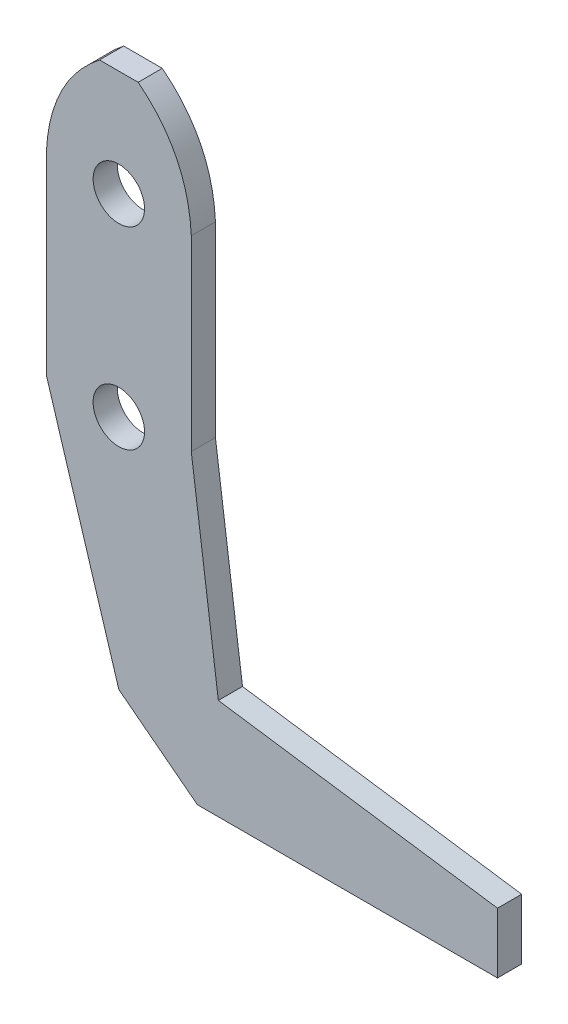
ISO-10303-21;
HEADER;
FILE_DESCRIPTION(('STEP AP214'),'2;1');
FILE_NAME('part.step','',(''),(''),'','','');
FILE_SCHEMA(('AUTOMOTIVE_DESIGN { 1 0 10303 214 1 1 1 1 }'));
ENDSEC;
DATA;
#1=APPLICATION_CONTEXT('core data for automotive mechanical design processes');
#2=APPLICATION_PROTOCOL_DEFINITION('international standard','automotive_design',2000,#1);
#3=PRODUCT_CONTEXT('',#1,'mechanical');
#4=PRODUCT('Part','Part','',(#3));
#5=PRODUCT_RELATED_PRODUCT_CATEGORY('part','',(#4));
#6=PRODUCT_DEFINITION_FORMATION('','',#4);
#7=PRODUCT_DEFINITION_CONTEXT('part definition',#1,'design');
#8=PRODUCT_DEFINITION('design','',#6,#7);
#9=PRODUCT_DEFINITION_SHAPE('','',#8);
#10=(LENGTH_UNIT() NAMED_UNIT(*) SI_UNIT(.MILLI.,.METRE.));
#11=(NAMED_UNIT(*) PLANE_ANGLE_UNIT() SI_UNIT($,.RADIAN.));
#12=(NAMED_UNIT(*) SI_UNIT($,.STERADIAN.) SOLID_ANGLE_UNIT());
#13=UNCERTAINTY_MEASURE_WITH_UNIT(LENGTH_MEASURE(1.E-05),#10,'distance_accuracy_value','');
#14=(GEOMETRIC_REPRESENTATION_CONTEXT(3) GLOBAL_UNCERTAINTY_ASSIGNED_CONTEXT((#13)) GLOBAL_UNIT_ASSIGNED_CONTEXT((#10,
#11,#12)) REPRESENTATION_CONTEXT('',''));
#15=CARTESIAN_POINT('',(0.,0.,0.));
#16=DIRECTION('',(0.,0.,1.));
#17=DIRECTION('',(1.,0.,0.));
#18=AXIS2_PLACEMENT_3D('',#15,#16,#17);
#19=CARTESIAN_POINT('',(8.33844644863385,7.13650378730396,2.143125));
#20=DIRECTION('',(0.,0.,1.));
#21=DIRECTION('',(1.,0.,0.));
#22=AXIS2_PLACEMENT_3D('',#19,#20,#21);
#23=PLANE('',#22);
#24=CARTESIAN_POINT('',(5.69106063842766,4.37384222116433,2.143125));
#25=DIRECTION('',(0.,0.,1.));
#26=DIRECTION('',(1.,0.,0.));
#27=AXIS2_PLACEMENT_3D('',#24,#25,#26);
#28=CIRCLE('',#27,1.18237);
#29=CARTESIAN_POINT('',(6.87343063842766,4.37384222116433,2.143125));
#30=VERTEX_POINT('',#29);
#31=EDGE_CURVE('E166',#30,#30,#28,.T.);
#32=ORIENTED_EDGE('',*,*,#31,.F.);
#33=EDGE_LOOP('',(#32));
#34=FACE_BOUND('',#33,.T.);
#35=DIRECTION('',(0.792396539647466,-0.610006331077574,0.));
#36=VECTOR('',#35,1.);
#37=CARTESIAN_POINT('',(5.69106063842766,-15.3751300809374,2.143125));
#38=LINE('',#37,#36);
#39=CARTESIAN_POINT('',(5.69106063842766,-15.3751300809374,2.143125));
#40=VERTEX_POINT('',#39);
#41=CARTESIAN_POINT('',(9.30549665683382,-18.1576117604807,2.143125));
#42=VERTEX_POINT('',#41);
#43=EDGE_CURVE('E203',#40,#42,#38,.T.);
#44=ORIENTED_EDGE('',*,*,#43,.T.);
#45=DIRECTION('',(1.,0.,0.));
#46=VECTOR('',#45,1.);
#47=CARTESIAN_POINT('',(9.30549665683382,-18.1576117604807,2.143125));
#48=LINE('',#47,#46);
#49=CARTESIAN_POINT('',(23.1115334550445,-18.1576117604807,2.143125));
#50=VERTEX_POINT('',#49);
#51=EDGE_CURVE('E108',#42,#50,#48,.T.);
#52=ORIENTED_EDGE('',*,*,#51,.T.);
#53=DIRECTION('',(0.,1.,0.));
#54=VECTOR('',#53,1.);
#55=CARTESIAN_POINT('',(23.1115334550445,-18.1576117604807,2.143125));
#56=LINE('',#55,#54);
#57=CARTESIAN_POINT('',(23.1115334550445,-15.3751300809374,2.143125));
#58=VERTEX_POINT('',#57);
#59=EDGE_CURVE('E236',#50,#58,#56,.T.);
#60=ORIENTED_EDGE('',*,*,#59,.T.);
#61=DIRECTION('',(-0.989728356843954,0.142960762655238,0.));
#62=VECTOR('',#61,1.);
#63=CARTESIAN_POINT('',(23.1115334550445,-15.3751300809374,2.143125));
#64=LINE('',#63,#62);
#65=CARTESIAN_POINT('',(10.2693103186908,-13.5201422945752,2.143125));
#66=VERTEX_POINT('',#65);
#67=EDGE_CURVE('E256',#58,#66,#64,.T.);
#68=ORIENTED_EDGE('',*,*,#67,.T.);
#69=DIRECTION('',(-0.132697105302083,0.99115663658397,0.));
#70=VECTOR('',#69,1.);
#71=CARTESIAN_POINT('',(10.2693103186908,-13.5201422945752,2.143125));
#72=LINE('',#71,#70);
#73=CARTESIAN_POINT('',(9.02481063842766,-4.22458068822784,2.143125));
#74=VERTEX_POINT('',#73);
#75=EDGE_CURVE('E252',#66,#74,#72,.T.);
#76=ORIENTED_EDGE('',*,*,#75,.T.);
#77=DIRECTION('',(0.,1.,0.));
#78=VECTOR('',#77,1.);
#79=CARTESIAN_POINT('',(9.02481063842766,4.37384222116433,2.143125));
#80=LINE('',#79,#78);
#81=CARTESIAN_POINT('',(9.02481063842766,4.37384222116433,2.143125));
#82=VERTEX_POINT('',#81);
#83=EDGE_CURVE('E255',#74,#82,#80,.T.);
#84=ORIENTED_EDGE('',*,*,#83,.T.);
#85=CARTESIAN_POINT('',(9.02481063842766,4.37384222116433,2.143125));
#86=CARTESIAN_POINT('',(8.87445725884004,7.45441535344359,2.143125));
#87=CARTESIAN_POINT('',(6.58006063842766,9.26334222116433,2.143125));
#88=B_SPLINE_CURVE_WITH_KNOTS('',2,(#85,#86,#87),.UNSPECIFIED.,.F.,.F.,(3,3),(0.,1.),.UNSPECIFIED.);
#89=CARTESIAN_POINT('',(6.58006063842766,9.26334222116433,2.143125));
#90=VERTEX_POINT('',#89);
#91=EDGE_CURVE('E260',#82,#90,#88,.T.);
#92=ORIENTED_EDGE('',*,*,#91,.T.);
#93=DIRECTION('',(-1.,0.,0.));
#94=VECTOR('',#93,1.);
#95=CARTESIAN_POINT('',(4.80206063842766,9.26334222116433,2.143125));
#96=LINE('',#95,#94);
#97=CARTESIAN_POINT('',(4.80206063842766,9.26334222116433,2.143125));
#98=VERTEX_POINT('',#97);
#99=EDGE_CURVE('E136',#90,#98,#96,.T.);
#100=ORIENTED_EDGE('',*,*,#99,.T.);
#101=CARTESIAN_POINT('',(4.80206063842766,9.26334222116433,2.143125));
#102=CARTESIAN_POINT('',(2.50766401801529,7.45441535344359,2.143125));
#103=CARTESIAN_POINT('',(2.35731063842766,4.37384222116433,2.143125));
#104=B_SPLINE_CURVE_WITH_KNOTS('',2,(#101,#102,#103),.UNSPECIFIED.,.F.,.F.,(3,3),(0.,1.),.UNSPECIFIED.);
#105=CARTESIAN_POINT('',(2.35731063842766,4.37384222116433,2.143125));
#106=VERTEX_POINT('',#105);
#107=EDGE_CURVE('E130',#98,#106,#104,.T.);
#108=ORIENTED_EDGE('',*,*,#107,.T.);
#109=DIRECTION('',(0.,-1.,0.));
#110=VECTOR('',#109,1.);
#111=CARTESIAN_POINT('',(2.35731063842766,4.37384222116433,2.143125));
#112=LINE('',#111,#110);
#113=CARTESIAN_POINT('',(2.35731063842766,-4.51615777883567,2.143125));
#114=VERTEX_POINT('',#113);
#115=EDGE_CURVE('E134',#106,#114,#112,.T.);
#116=ORIENTED_EDGE('',*,*,#115,.T.);
#117=DIRECTION('',(0.293484867653749,-0.95596371921651,0.));
#118=VECTOR('',#117,1.);
#119=CARTESIAN_POINT('',(2.35731063842766,-4.51615777883567,2.143125));
#120=LINE('',#119,#118);
#121=EDGE_CURVE('E56',#114,#40,#120,.T.);
#122=ORIENTED_EDGE('',*,*,#121,.T.);
#123=EDGE_LOOP('',(#44,#52,#60,#68,#76,#84,#92,#100,#108,#116,#122));
#124=FACE_BOUND('',#123,.T.);
#125=CARTESIAN_POINT('',(5.69106063842766,-4.51615777883567,2.143125));
#126=DIRECTION('',(0.,0.,1.));
#127=DIRECTION('',(1.,0.,0.));
#128=AXIS2_PLACEMENT_3D('',#125,#126,#127);
#129=CIRCLE('',#128,1.18237);
#130=CARTESIAN_POINT('',(6.87343063842766,-4.51615777883567,2.143125));
#131=VERTEX_POINT('',#130);
#132=EDGE_CURVE('E333',#131,#131,#129,.T.);
#133=ORIENTED_EDGE('',*,*,#132,.F.);
#134=EDGE_LOOP('',(#133));
#135=FACE_BOUND('',#134,.T.);
#136=ADVANCED_FACE('F38',(#34,#124,#135),#23,.T.);
#137=CARTESIAN_POINT('',(8.33844644863385,7.13650378730396,1.031875));
#138=DIRECTION('',(0.,0.,1.));
#139=DIRECTION('',(1.,0.,0.));
#140=AXIS2_PLACEMENT_3D('',#137,#138,#139);
#141=PLANE('',#140);
#142=DIRECTION('',(0.792396539647466,-0.610006331077574,0.));
#143=VECTOR('',#142,1.);
#144=CARTESIAN_POINT('',(5.69106063842766,-15.3751300809374,1.031875));
#145=LINE('',#144,#143);
#146=CARTESIAN_POINT('',(5.69106063842766,-15.3751300809374,1.031875));
#147=VERTEX_POINT('',#146);
#148=CARTESIAN_POINT('',(9.30549665683382,-18.1576117604807,1.031875));
#149=VERTEX_POINT('',#148);
#150=EDGE_CURVE('E161',#147,#149,#145,.T.);
#151=ORIENTED_EDGE('',*,*,#150,.F.);
#152=DIRECTION('',(0.293484867653749,-0.95596371921651,0.));
#153=VECTOR('',#152,1.);
#154=CARTESIAN_POINT('',(2.35731063842766,-4.51615777883567,1.031875));
#155=LINE('',#154,#153);
#156=CARTESIAN_POINT('',(2.35731063842766,-4.51615777883567,1.031875));
#157=VERTEX_POINT('',#156);
#158=EDGE_CURVE('E100',#157,#147,#155,.T.);
#159=ORIENTED_EDGE('',*,*,#158,.F.);
#160=DIRECTION('',(0.,-1.,0.));
#161=VECTOR('',#160,1.);
#162=CARTESIAN_POINT('',(2.35731063842766,4.37384222116433,1.031875));
#163=LINE('',#162,#161);
#164=CARTESIAN_POINT('',(2.35731063842766,4.37384222116433,1.031875));
#165=VERTEX_POINT('',#164);
#166=EDGE_CURVE('E94',#165,#157,#163,.T.);
#167=ORIENTED_EDGE('',*,*,#166,.F.);
#168=CARTESIAN_POINT('',(4.80206063842766,9.26334222116433,1.031875));
#169=CARTESIAN_POINT('',(2.50766401801529,7.45441535344359,1.031875));
#170=CARTESIAN_POINT('',(2.35731063842766,4.37384222116433,1.031875));
#171=B_SPLINE_CURVE_WITH_KNOTS('',2,(#168,#169,#170),.UNSPECIFIED.,.F.,.F.,(3,3),(0.,1.),.UNSPECIFIED.);
#172=CARTESIAN_POINT('',(4.80206063842766,9.26334222116433,1.031875));
#173=VERTEX_POINT('',#172);
#174=EDGE_CURVE('E145',#173,#165,#171,.T.);
#175=ORIENTED_EDGE('',*,*,#174,.F.);
#176=DIRECTION('',(-1.,0.,0.));
#177=VECTOR('',#176,1.);
#178=CARTESIAN_POINT('',(4.80206063842766,9.26334222116433,1.031875));
#179=LINE('',#178,#177);
#180=CARTESIAN_POINT('',(6.58006063842766,9.26334222116433,1.031875));
#181=VERTEX_POINT('',#180);
#182=EDGE_CURVE('E186',#181,#173,#179,.T.);
#183=ORIENTED_EDGE('',*,*,#182,.F.);
#184=CARTESIAN_POINT('',(9.02481063842766,4.37384222116433,1.031875));
#185=CARTESIAN_POINT('',(8.87445725884004,7.45441535344359,1.031875));
#186=CARTESIAN_POINT('',(6.58006063842766,9.26334222116433,1.031875));
#187=B_SPLINE_CURVE_WITH_KNOTS('',2,(#184,#185,#186),.UNSPECIFIED.,.F.,.F.,(3,3),(0.,1.),.UNSPECIFIED.);
#188=CARTESIAN_POINT('',(9.02481063842766,4.37384222116433,1.031875));
#189=VERTEX_POINT('',#188);
#190=EDGE_CURVE('E181',#189,#181,#187,.T.);
#191=ORIENTED_EDGE('',*,*,#190,.F.);
#192=DIRECTION('',(0.,1.,0.));
#193=VECTOR('',#192,1.);
#194=CARTESIAN_POINT('',(9.02481063842766,4.37384222116433,1.031875));
#195=LINE('',#194,#193);
#196=CARTESIAN_POINT('',(9.02481063842766,-4.22458068822784,1.031875));
#197=VERTEX_POINT('',#196);
#198=EDGE_CURVE('E178',#197,#189,#195,.T.);
#199=ORIENTED_EDGE('',*,*,#198,.F.);
#200=DIRECTION('',(-0.132697105302083,0.99115663658397,0.));
#201=VECTOR('',#200,1.);
#202=CARTESIAN_POINT('',(10.2693103186908,-13.5201422945752,1.031875));
#203=LINE('',#202,#201);
#204=CARTESIAN_POINT('',(10.2693103186908,-13.5201422945752,1.031875));
#205=VERTEX_POINT('',#204);
#206=EDGE_CURVE('E175',#205,#197,#203,.T.);
#207=ORIENTED_EDGE('',*,*,#206,.F.);
#208=DIRECTION('',(-0.989728356843954,0.142960762655238,0.));
#209=VECTOR('',#208,1.);
#210=CARTESIAN_POINT('',(23.1115334550445,-15.3751300809374,1.031875));
#211=LINE('',#210,#209);
#212=CARTESIAN_POINT('',(23.1115334550445,-15.3751300809374,1.031875));
#213=VERTEX_POINT('',#212);
#214=EDGE_CURVE('E172',#213,#205,#211,.T.);
#215=ORIENTED_EDGE('',*,*,#214,.F.);
#216=DIRECTION('',(0.,1.,0.));
#217=VECTOR('',#216,1.);
#218=CARTESIAN_POINT('',(23.1115334550445,-18.1576117604807,1.031875));
#219=LINE('',#218,#217);
#220=CARTESIAN_POINT('',(23.1115334550445,-18.1576117604807,1.031875));
#221=VERTEX_POINT('',#220);
#222=EDGE_CURVE('E169',#221,#213,#219,.T.);
#223=ORIENTED_EDGE('',*,*,#222,.F.);
#224=DIRECTION('',(1.,0.,0.));
#225=VECTOR('',#224,1.);
#226=CARTESIAN_POINT('',(9.30549665683382,-18.1576117604807,1.031875));
#227=LINE('',#226,#225);
#228=EDGE_CURVE('E165',#149,#221,#227,.T.);
#229=ORIENTED_EDGE('',*,*,#228,.F.);
#230=EDGE_LOOP('',(#151,#159,#167,#175,#183,#191,#199,#207,#215,#223,#229));
#231=FACE_BOUND('',#230,.T.);
#232=CARTESIAN_POINT('',(5.69106063842766,4.37384222116433,1.031875));
#233=DIRECTION('',(0.,0.,1.));
#234=DIRECTION('',(1.,0.,0.));
#235=AXIS2_PLACEMENT_3D('',#232,#233,#234);
#236=CIRCLE('',#235,1.18237);
#237=CARTESIAN_POINT('',(6.87343063842766,4.37384222116433,1.031875));
#238=VERTEX_POINT('',#237);
#239=EDGE_CURVE('E328',#238,#238,#236,.T.);
#240=ORIENTED_EDGE('',*,*,#239,.T.);
#241=EDGE_LOOP('',(#240));
#242=FACE_BOUND('',#241,.T.);
#243=CARTESIAN_POINT('',(5.69106063842766,-4.51615777883567,1.031875));
#244=DIRECTION('',(0.,0.,1.));
#245=DIRECTION('',(1.,0.,0.));
#246=AXIS2_PLACEMENT_3D('',#243,#244,#245);
#247=CIRCLE('',#246,1.18237);
#248=CARTESIAN_POINT('',(6.87343063842766,-4.51615777883567,1.031875));
#249=VERTEX_POINT('',#248);
#250=EDGE_CURVE('E337',#249,#249,#247,.T.);
#251=ORIENTED_EDGE('',*,*,#250,.T.);
#252=EDGE_LOOP('',(#251));
#253=FACE_BOUND('',#252,.T.);
#254=ADVANCED_FACE('F240',(#231,#242,#253),#141,.F.);
#255=CARTESIAN_POINT('',(5.69106063842766,-15.3751300809374,2.143125));
#256=DIRECTION('',(0.610006331077574,0.792396539647466,0.));
#257=DIRECTION('',(-0.792396539647466,0.610006331077574,0.));
#258=AXIS2_PLACEMENT_3D('',#255,#256,#257);
#259=PLANE('',#258);
#260=ORIENTED_EDGE('',*,*,#150,.T.);
#261=DIRECTION('',(0.,0.,-1.));
#262=VECTOR('',#261,1.);
#263=CARTESIAN_POINT('',(9.30549665683382,-18.1576117604807,2.143125));
#264=LINE('',#263,#262);
#265=EDGE_CURVE('E11',#42,#149,#264,.T.);
#266=ORIENTED_EDGE('',*,*,#265,.F.);
#267=ORIENTED_EDGE('',*,*,#43,.F.);
#268=DIRECTION('',(0.,0.,-1.));
#269=VECTOR('',#268,1.);
#270=CARTESIAN_POINT('',(5.69106063842766,-15.3751300809374,2.143125));
#271=LINE('',#270,#269);
#272=EDGE_CURVE('E154',#40,#147,#271,.T.);
#273=ORIENTED_EDGE('',*,*,#272,.T.);
#274=EDGE_LOOP('',(#260,#266,#267,#273));
#275=FACE_BOUND('',#274,.T.);
#276=ADVANCED_FACE('F40',(#275),#259,.F.);
#277=CARTESIAN_POINT('',(9.30549665683382,-18.1576117604807,2.143125));
#278=DIRECTION('',(0.,1.,0.));
#279=DIRECTION('',(0.,0.,1.));
#280=AXIS2_PLACEMENT_3D('',#277,#278,#279);
#281=PLANE('',#280);
#282=ORIENTED_EDGE('',*,*,#228,.T.);
#283=DIRECTION('',(0.,0.,-1.));
#284=VECTOR('',#283,1.);
#285=CARTESIAN_POINT('',(23.1115334550445,-18.1576117604807,2.143125));
#286=LINE('',#285,#284);
#287=EDGE_CURVE('E48',#50,#221,#286,.T.);
#288=ORIENTED_EDGE('',*,*,#287,.F.);
#289=ORIENTED_EDGE('',*,*,#51,.F.);
#290=ORIENTED_EDGE('',*,*,#265,.T.);
#291=EDGE_LOOP('',(#282,#288,#289,#290));
#292=FACE_BOUND('',#291,.T.);
#293=ADVANCED_FACE('F289',(#292),#281,.F.);
#294=CARTESIAN_POINT('',(23.1115334550445,-18.1576117604807,2.143125));
#295=DIRECTION('',(-1.,0.,0.));
#296=DIRECTION('',(0.,0.,1.));
#297=AXIS2_PLACEMENT_3D('',#294,#295,#296);
#298=PLANE('',#297);
#299=ORIENTED_EDGE('',*,*,#222,.T.);
#300=DIRECTION('',(0.,0.,-1.));
#301=VECTOR('',#300,1.);
#302=CARTESIAN_POINT('',(23.1115334550445,-15.3751300809374,2.143125));
#303=LINE('',#302,#301);
#304=EDGE_CURVE('E226',#58,#213,#303,.T.);
#305=ORIENTED_EDGE('',*,*,#304,.F.);
#306=ORIENTED_EDGE('',*,*,#59,.F.);
#307=ORIENTED_EDGE('',*,*,#287,.T.);
#308=EDGE_LOOP('',(#299,#305,#306,#307));
#309=FACE_BOUND('',#308,.T.);
#310=ADVANCED_FACE('F234',(#309),#298,.F.);
#311=CARTESIAN_POINT('',(23.1115334550445,-15.3751300809374,2.143125));
#312=DIRECTION('',(-0.142960762655238,-0.989728356843954,0.));
#313=DIRECTION('',(0.989728356843954,-0.142960762655238,0.));
#314=AXIS2_PLACEMENT_3D('',#311,#312,#313);
#315=PLANE('',#314);
#316=ORIENTED_EDGE('',*,*,#214,.T.);
#317=DIRECTION('',(0.,0.,-1.));
#318=VECTOR('',#317,1.);
#319=CARTESIAN_POINT('',(10.2693103186908,-13.5201422945752,2.143125));
#320=LINE('',#319,#318);
#321=EDGE_CURVE('E222',#66,#205,#320,.T.);
#322=ORIENTED_EDGE('',*,*,#321,.F.);
#323=ORIENTED_EDGE('',*,*,#67,.F.);
#324=ORIENTED_EDGE('',*,*,#304,.T.);
#325=EDGE_LOOP('',(#316,#322,#323,#324));
#326=FACE_BOUND('',#325,.T.);
#327=ADVANCED_FACE('F246',(#326),#315,.F.);
#328=CARTESIAN_POINT('',(10.2693103186908,-13.5201422945752,2.143125));
#329=DIRECTION('',(-0.99115663658397,-0.132697105302083,0.));
#330=DIRECTION('',(0.132697105302083,-0.99115663658397,0.));
#331=AXIS2_PLACEMENT_3D('',#328,#329,#330);
#332=PLANE('',#331);
#333=ORIENTED_EDGE('',*,*,#206,.T.);
#334=DIRECTION('',(0.,0.,-1.));
#335=VECTOR('',#334,1.);
#336=CARTESIAN_POINT('',(9.02481063842766,-4.22458068822784,2.143125));
#337=LINE('',#336,#335);
#338=EDGE_CURVE('E218',#74,#197,#337,.T.);
#339=ORIENTED_EDGE('',*,*,#338,.F.);
#340=ORIENTED_EDGE('',*,*,#75,.F.);
#341=ORIENTED_EDGE('',*,*,#321,.T.);
#342=EDGE_LOOP('',(#333,#339,#340,#341));
#343=FACE_BOUND('',#342,.T.);
#344=ADVANCED_FACE('F250',(#343),#332,.F.);
#345=CARTESIAN_POINT('',(9.02481063842766,4.37384222116433,2.143125));
#346=DIRECTION('',(-1.,0.,0.));
#347=DIRECTION('',(0.,-1.,0.));
#348=AXIS2_PLACEMENT_3D('',#345,#346,#347);
#349=PLANE('',#348);
#350=ORIENTED_EDGE('',*,*,#198,.T.);
#351=DIRECTION('',(0.,0.,-1.));
#352=VECTOR('',#351,1.);
#353=CARTESIAN_POINT('',(9.02481063842766,4.37384222116433,2.143125));
#354=LINE('',#353,#352);
#355=EDGE_CURVE('E214',#82,#189,#354,.T.);
#356=ORIENTED_EDGE('',*,*,#355,.F.);
#357=ORIENTED_EDGE('',*,*,#83,.F.);
#358=ORIENTED_EDGE('',*,*,#338,.T.);
#359=EDGE_LOOP('',(#350,#356,#357,#358));
#360=FACE_BOUND('',#359,.T.);
#361=ADVANCED_FACE('F278',(#360),#349,.F.);
#362=DIRECTION('',(0.,0.,-1.));
#363=VECTOR('',#362,1.);
#364=SURFACE_OF_LINEAR_EXTRUSION('',#88,#363);
#365=ORIENTED_EDGE('',*,*,#190,.T.);
#366=DIRECTION('',(0.,0.,-1.));
#367=VECTOR('',#366,1.);
#368=CARTESIAN_POINT('',(6.58006063842766,9.26334222116433,2.143125));
#369=LINE('',#368,#367);
#370=EDGE_CURVE('E210',#90,#181,#369,.T.);
#371=ORIENTED_EDGE('',*,*,#370,.F.);
#372=ORIENTED_EDGE('',*,*,#91,.F.);
#373=ORIENTED_EDGE('',*,*,#355,.T.);
#374=EDGE_LOOP('',(#365,#371,#372,#373));
#375=FACE_BOUND('',#374,.T.);
#376=ADVANCED_FACE('F273',(#375),#364,.F.);
#377=CARTESIAN_POINT('',(4.80206063842766,9.26334222116433,2.143125));
#378=DIRECTION('',(0.,-1.,0.));
#379=DIRECTION('',(0.,0.,-1.));
#380=AXIS2_PLACEMENT_3D('',#377,#378,#379);
#381=PLANE('',#380);
#382=ORIENTED_EDGE('',*,*,#182,.T.);
#383=DIRECTION('',(0.,0.,-1.));
#384=VECTOR('',#383,1.);
#385=CARTESIAN_POINT('',(4.80206063842766,9.26334222116433,2.143125));
#386=LINE('',#385,#384);
#387=EDGE_CURVE('E147',#98,#173,#386,.T.);
#388=ORIENTED_EDGE('',*,*,#387,.F.);
#389=ORIENTED_EDGE('',*,*,#99,.F.);
#390=ORIENTED_EDGE('',*,*,#370,.T.);
#391=EDGE_LOOP('',(#382,#388,#389,#390));
#392=FACE_BOUND('',#391,.T.);
#393=ADVANCED_FACE('F277',(#392),#381,.F.);
#394=DIRECTION('',(0.,0.,-1.));
#395=VECTOR('',#394,1.);
#396=SURFACE_OF_LINEAR_EXTRUSION('',#104,#395);
#397=ORIENTED_EDGE('',*,*,#174,.T.);
#398=DIRECTION('',(0.,0.,-1.));
#399=VECTOR('',#398,1.);
#400=CARTESIAN_POINT('',(2.35731063842766,4.37384222116433,2.143125));
#401=LINE('',#400,#399);
#402=EDGE_CURVE('E142',#106,#165,#401,.T.);
#403=ORIENTED_EDGE('',*,*,#402,.F.);
#404=ORIENTED_EDGE('',*,*,#107,.F.);
#405=ORIENTED_EDGE('',*,*,#387,.T.);
#406=EDGE_LOOP('',(#397,#403,#404,#405));
#407=FACE_BOUND('',#406,.T.);
#408=ADVANCED_FACE('F143',(#407),#396,.F.);
#409=CARTESIAN_POINT('',(2.35731063842766,4.37384222116433,2.143125));
#410=DIRECTION('',(1.,0.,0.));
#411=DIRECTION('',(0.,0.,-1.));
#412=AXIS2_PLACEMENT_3D('',#409,#410,#411);
#413=PLANE('',#412);
#414=ORIENTED_EDGE('',*,*,#166,.T.);
#415=DIRECTION('',(0.,0.,-1.));
#416=VECTOR('',#415,1.);
#417=CARTESIAN_POINT('',(2.35731063842766,-4.51615777883567,2.143125));
#418=LINE('',#417,#416);
#419=EDGE_CURVE('E148',#114,#157,#418,.T.);
#420=ORIENTED_EDGE('',*,*,#419,.F.);
#421=ORIENTED_EDGE('',*,*,#115,.F.);
#422=ORIENTED_EDGE('',*,*,#402,.T.);
#423=EDGE_LOOP('',(#414,#420,#421,#422));
#424=FACE_BOUND('',#423,.T.);
#425=ADVANCED_FACE('F150',(#424),#413,.F.);
#426=CARTESIAN_POINT('',(2.35731063842766,-4.51615777883567,2.143125));
#427=DIRECTION('',(0.95596371921651,0.293484867653749,0.));
#428=DIRECTION('',(-0.293484867653749,0.95596371921651,0.));
#429=AXIS2_PLACEMENT_3D('',#426,#427,#428);
#430=PLANE('',#429);
#431=ORIENTED_EDGE('',*,*,#158,.T.);
#432=ORIENTED_EDGE('',*,*,#272,.F.);
#433=ORIENTED_EDGE('',*,*,#121,.F.);
#434=ORIENTED_EDGE('',*,*,#419,.T.);
#435=EDGE_LOOP('',(#431,#432,#433,#434));
#436=FACE_BOUND('',#435,.T.);
#437=ADVANCED_FACE('F307',(#436),#430,.F.);
#438=CARTESIAN_POINT('',(5.69106063842766,4.37384222116433,2.143125));
#439=DIRECTION('',(0.,0.,-1.));
#440=DIRECTION('',(-1.,0.,0.));
#441=AXIS2_PLACEMENT_3D('',#438,#439,#440);
#442=CYLINDRICAL_SURFACE('',#441,1.18237);
#443=ORIENTED_EDGE('',*,*,#31,.T.);
#444=EDGE_LOOP('',(#443));
#445=FACE_BOUND('',#444,.T.);
#446=ORIENTED_EDGE('',*,*,#239,.F.);
#447=EDGE_LOOP('',(#446));
#448=FACE_BOUND('',#447,.T.);
#449=ADVANCED_FACE('F304',(#445,#448),#442,.F.);
#450=CARTESIAN_POINT('',(5.69106063842766,-4.51615777883567,2.143125));
#451=DIRECTION('',(0.,0.,-1.));
#452=DIRECTION('',(-1.,0.,0.));
#453=AXIS2_PLACEMENT_3D('',#450,#451,#452);
#454=CYLINDRICAL_SURFACE('',#453,1.18237);
#455=ORIENTED_EDGE('',*,*,#132,.T.);
#456=EDGE_LOOP('',(#455));
#457=FACE_BOUND('',#456,.T.);
#458=ORIENTED_EDGE('',*,*,#250,.F.);
#459=EDGE_LOOP('',(#458));
#460=FACE_BOUND('',#459,.T.);
#461=ADVANCED_FACE('F345',(#457,#460),#454,.F.);
#462=CLOSED_SHELL('',(#136,#254,#276,#293,#310,#327,#344,#361,#376,#393,#408,#425,#437,#449,#461));
#463=MANIFOLD_SOLID_BREP('B2',#462);
#464=ADVANCED_BREP_SHAPE_REPRESENTATION('',(#18,#463),#14);
#465=SHAPE_DEFINITION_REPRESENTATION(#9,#464);
ENDSEC;
END-ISO-10303-21;
